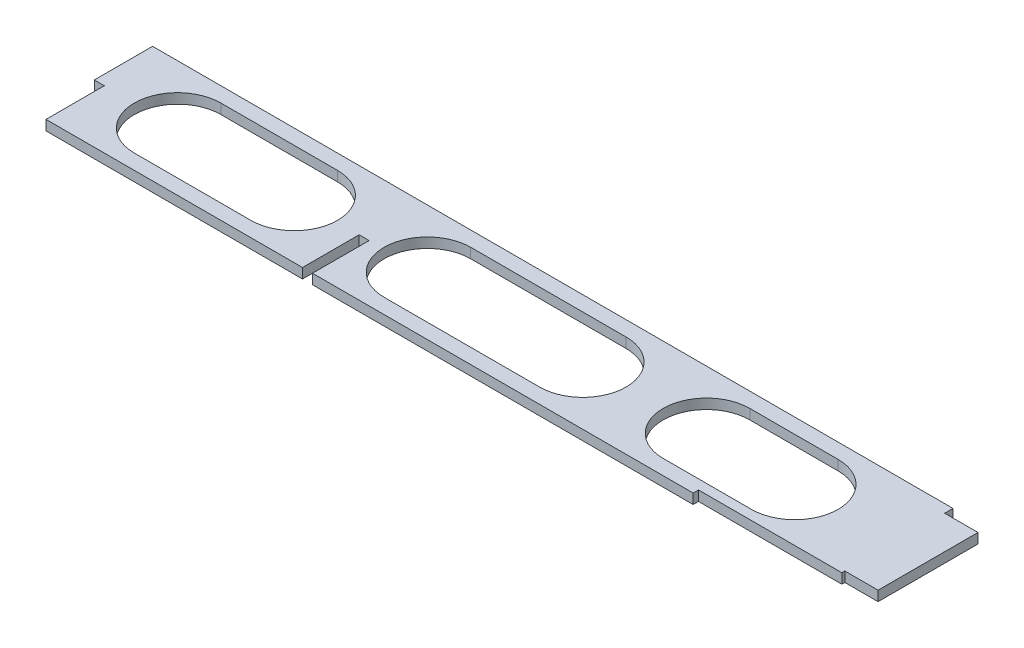
ISO-10303-21;
HEADER;
FILE_DESCRIPTION(('STEP AP214'),'2;1');
FILE_NAME('part.step','',(''),(''),'','','');
FILE_SCHEMA(('AUTOMOTIVE_DESIGN { 1 0 10303 214 1 1 1 1 }'));
ENDSEC;
DATA;
#1=APPLICATION_CONTEXT('core data for automotive mechanical design processes');
#2=APPLICATION_PROTOCOL_DEFINITION('international standard','automotive_design',2000,#1);
#3=PRODUCT_CONTEXT('',#1,'mechanical');
#4=PRODUCT('Part','Part','',(#3));
#5=PRODUCT_RELATED_PRODUCT_CATEGORY('part','',(#4));
#6=PRODUCT_DEFINITION_FORMATION('','',#4);
#7=PRODUCT_DEFINITION_CONTEXT('part definition',#1,'design');
#8=PRODUCT_DEFINITION('design','',#6,#7);
#9=PRODUCT_DEFINITION_SHAPE('','',#8);
#10=(LENGTH_UNIT() NAMED_UNIT(*) SI_UNIT(.MILLI.,.METRE.));
#11=(NAMED_UNIT(*) PLANE_ANGLE_UNIT() SI_UNIT($,.RADIAN.));
#12=(NAMED_UNIT(*) SI_UNIT($,.STERADIAN.) SOLID_ANGLE_UNIT());
#13=UNCERTAINTY_MEASURE_WITH_UNIT(LENGTH_MEASURE(1.E-05),#10,'distance_accuracy_value','');
#14=(GEOMETRIC_REPRESENTATION_CONTEXT(3) GLOBAL_UNCERTAINTY_ASSIGNED_CONTEXT((#13)) GLOBAL_UNIT_ASSIGNED_CONTEXT((#10,
#11,#12)) REPRESENTATION_CONTEXT('',''));
#15=CARTESIAN_POINT('',(0.,0.,0.));
#16=DIRECTION('',(0.,0.,1.));
#17=DIRECTION('',(1.,0.,0.));
#18=AXIS2_PLACEMENT_3D('',#15,#16,#17);
#19=CARTESIAN_POINT('',(0.,3.,17.5));
#20=DIRECTION('',(0.,0.,-1.));
#21=DIRECTION('',(-1.,0.,0.));
#22=AXIS2_PLACEMENT_3D('',#19,#20,#21);
#23=PLANE('',#22);
#24=DIRECTION('',(1.,0.,0.));
#25=VECTOR('',#24,1.);
#26=CARTESIAN_POINT('',(0.,3.,17.5));
#27=LINE('',#26,#25);
#28=CARTESIAN_POINT('',(3.,3.,17.5));
#29=VERTEX_POINT('',#28);
#30=CARTESIAN_POINT('',(80.,3.,17.5));
#31=VERTEX_POINT('',#30);
#32=EDGE_CURVE('E385',#29,#31,#27,.T.);
#33=ORIENTED_EDGE('',*,*,#32,.F.);
#34=DIRECTION('',(0.,1.,0.));
#35=VECTOR('',#34,1.);
#36=CARTESIAN_POINT('',(3.,-7.,17.5));
#37=LINE('',#36,#35);
#38=CARTESIAN_POINT('',(3.,0.,17.5));
#39=VERTEX_POINT('',#38);
#40=EDGE_CURVE('E410',#39,#29,#37,.T.);
#41=ORIENTED_EDGE('',*,*,#40,.F.);
#42=DIRECTION('',(1.,0.,0.));
#43=VECTOR('',#42,1.);
#44=CARTESIAN_POINT('',(0.,0.,17.5));
#45=LINE('',#44,#43);
#46=CARTESIAN_POINT('',(80.,0.,17.5));
#47=VERTEX_POINT('',#46);
#48=EDGE_CURVE('E396',#39,#47,#45,.T.);
#49=ORIENTED_EDGE('',*,*,#48,.T.);
#50=DIRECTION('',(0.,1.,0.));
#51=VECTOR('',#50,1.);
#52=CARTESIAN_POINT('',(80.,0.,17.5));
#53=LINE('',#52,#51);
#54=EDGE_CURVE('E363',#47,#31,#53,.T.);
#55=ORIENTED_EDGE('',*,*,#54,.T.);
#56=EDGE_LOOP('',(#33,#41,#49,#55));
#57=FACE_BOUND('',#56,.T.);
#58=ADVANCED_FACE('F36',(#57),#23,.F.);
#59=CARTESIAN_POINT('',(0.,3.,-17.5));
#60=DIRECTION('',(1.,0.,0.));
#61=DIRECTION('',(0.,0.,-1.));
#62=AXIS2_PLACEMENT_3D('',#59,#60,#61);
#63=PLANE('',#62);
#64=DIRECTION('',(0.,0.,1.));
#65=VECTOR('',#64,1.);
#66=CARTESIAN_POINT('',(0.,0.,-17.5));
#67=LINE('',#66,#65);
#68=CARTESIAN_POINT('',(0.,0.,-17.5));
#69=VERTEX_POINT('',#68);
#70=CARTESIAN_POINT('',(0.,0.,0.));
#71=VERTEX_POINT('',#70);
#72=EDGE_CURVE('E373',#69,#71,#67,.T.);
#73=ORIENTED_EDGE('',*,*,#72,.T.);
#74=DIRECTION('',(0.,1.,0.));
#75=VECTOR('',#74,1.);
#76=CARTESIAN_POINT('',(0.,-7.,0.));
#77=LINE('',#76,#75);
#78=CARTESIAN_POINT('',(0.,3.,0.));
#79=VERTEX_POINT('',#78);
#80=EDGE_CURVE('E417',#71,#79,#77,.T.);
#81=ORIENTED_EDGE('',*,*,#80,.T.);
#82=DIRECTION('',(0.,0.,1.));
#83=VECTOR('',#82,1.);
#84=CARTESIAN_POINT('',(0.,3.,-17.5));
#85=LINE('',#84,#83);
#86=CARTESIAN_POINT('',(0.,3.,-17.5));
#87=VERTEX_POINT('',#86);
#88=EDGE_CURVE('E380',#87,#79,#85,.T.);
#89=ORIENTED_EDGE('',*,*,#88,.F.);
#90=DIRECTION('',(0.,-1.,0.));
#91=VECTOR('',#90,1.);
#92=CARTESIAN_POINT('',(0.,3.,-17.5));
#93=LINE('',#92,#91);
#94=EDGE_CURVE('E392',#87,#69,#93,.T.);
#95=ORIENTED_EDGE('',*,*,#94,.T.);
#96=EDGE_LOOP('',(#73,#81,#89,#95));
#97=FACE_BOUND('',#96,.T.);
#98=ADVANCED_FACE('F38',(#97),#63,.F.);
#99=CARTESIAN_POINT('',(83.,0.,17.5));
#100=VERTEX_POINT('',#99);
#101=CARTESIAN_POINT('',(197.28,0.,17.5));
#102=VERTEX_POINT('',#101);
#103=EDGE_CURVE('E395',#100,#102,#45,.T.);
#104=ORIENTED_EDGE('',*,*,#103,.T.);
#105=DIRECTION('',(0.,-1.,0.));
#106=VECTOR('',#105,1.);
#107=CARTESIAN_POINT('',(197.28,2.99999999999999,17.5));
#108=LINE('',#107,#106);
#109=CARTESIAN_POINT('',(197.28,2.99999999999999,17.5));
#110=VERTEX_POINT('',#109);
#111=EDGE_CURVE('E228',#110,#102,#108,.T.);
#112=ORIENTED_EDGE('',*,*,#111,.F.);
#113=CARTESIAN_POINT('',(83.,3.,17.5));
#114=VERTEX_POINT('',#113);
#115=EDGE_CURVE('E383',#114,#110,#27,.T.);
#116=ORIENTED_EDGE('',*,*,#115,.F.);
#117=DIRECTION('',(0.,1.,0.));
#118=VECTOR('',#117,1.);
#119=CARTESIAN_POINT('',(83.,0.,17.5));
#120=LINE('',#119,#118);
#121=EDGE_CURVE('E376',#100,#114,#120,.T.);
#122=ORIENTED_EDGE('',*,*,#121,.F.);
#123=EDGE_LOOP('',(#104,#112,#116,#122));
#124=FACE_BOUND('',#123,.T.);
#125=ADVANCED_FACE('F476',(#124),#23,.F.);
#126=CARTESIAN_POINT('',(250.28,3.,-17.5));
#127=DIRECTION('',(-1.,0.,0.));
#128=DIRECTION('',(0.,0.,1.));
#129=AXIS2_PLACEMENT_3D('',#126,#127,#128);
#130=PLANE('',#129);
#131=DIRECTION('',(0.,0.,-1.));
#132=VECTOR('',#131,1.);
#133=CARTESIAN_POINT('',(250.28,0.,-17.5));
#134=LINE('',#133,#132);
#135=CARTESIAN_POINT('',(250.28,0.,15.));
#136=VERTEX_POINT('',#135);
#137=CARTESIAN_POINT('',(250.28,0.,-15.));
#138=VERTEX_POINT('',#137);
#139=EDGE_CURVE('E398',#136,#138,#134,.T.);
#140=ORIENTED_EDGE('',*,*,#139,.T.);
#141=DIRECTION('',(0.,1.,0.));
#142=VECTOR('',#141,1.);
#143=CARTESIAN_POINT('',(250.28,-10.3077640640442,-15.));
#144=LINE('',#143,#142);
#145=CARTESIAN_POINT('',(250.28,3.,-15.));
#146=VERTEX_POINT('',#145);
#147=EDGE_CURVE('E426',#138,#146,#144,.T.);
#148=ORIENTED_EDGE('',*,*,#147,.T.);
#149=DIRECTION('',(0.,0.,-1.));
#150=VECTOR('',#149,1.);
#151=CARTESIAN_POINT('',(250.28,3.,-17.5));
#152=LINE('',#151,#150);
#153=CARTESIAN_POINT('',(250.28,3.,15.));
#154=VERTEX_POINT('',#153);
#155=EDGE_CURVE('E387',#154,#146,#152,.T.);
#156=ORIENTED_EDGE('',*,*,#155,.F.);
#157=DIRECTION('',(0.,1.,0.));
#158=VECTOR('',#157,1.);
#159=CARTESIAN_POINT('',(250.28,-10.3077640640442,15.));
#160=LINE('',#159,#158);
#161=EDGE_CURVE('E245',#136,#154,#160,.T.);
#162=ORIENTED_EDGE('',*,*,#161,.F.);
#163=EDGE_LOOP('',(#140,#148,#156,#162));
#164=FACE_BOUND('',#163,.T.);
#165=ADVANCED_FACE('F460',(#164),#130,.F.);
#166=CARTESIAN_POINT('',(0.,3.,-17.5));
#167=DIRECTION('',(0.,0.,1.));
#168=DIRECTION('',(1.,0.,0.));
#169=AXIS2_PLACEMENT_3D('',#166,#167,#168);
#170=PLANE('',#169);
#171=DIRECTION('',(-1.,0.,0.));
#172=VECTOR('',#171,1.);
#173=CARTESIAN_POINT('',(0.,3.,-17.5));
#174=LINE('',#173,#172);
#175=CARTESIAN_POINT('',(240.28,3.,-17.5));
#176=VERTEX_POINT('',#175);
#177=EDGE_CURVE('E390',#176,#87,#174,.T.);
#178=ORIENTED_EDGE('',*,*,#177,.F.);
#179=DIRECTION('',(0.,1.,0.));
#180=VECTOR('',#179,1.);
#181=CARTESIAN_POINT('',(240.28,-10.3077640640442,-17.5));
#182=LINE('',#181,#180);
#183=CARTESIAN_POINT('',(240.28,0.,-17.5));
#184=VERTEX_POINT('',#183);
#185=EDGE_CURVE('E431',#184,#176,#182,.T.);
#186=ORIENTED_EDGE('',*,*,#185,.F.);
#187=DIRECTION('',(-1.,0.,0.));
#188=VECTOR('',#187,1.);
#189=CARTESIAN_POINT('',(0.,0.,-17.5));
#190=LINE('',#189,#188);
#191=EDGE_CURVE('E384',#184,#69,#190,.T.);
#192=ORIENTED_EDGE('',*,*,#191,.T.);
#193=ORIENTED_EDGE('',*,*,#94,.F.);
#194=EDGE_LOOP('',(#178,#186,#192,#193));
#195=FACE_BOUND('',#194,.T.);
#196=ADVANCED_FACE('F472',(#195),#170,.F.);
#197=CARTESIAN_POINT('',(0.,3.,0.));
#198=DIRECTION('',(0.,1.,0.));
#199=DIRECTION('',(0.,0.,1.));
#200=AXIS2_PLACEMENT_3D('',#197,#198,#199);
#201=PLANE('',#200);
#202=DIRECTION('',(0.,0.,1.));
#203=VECTOR('',#202,1.);
#204=CARTESIAN_POINT('',(197.28,2.99999999999999,15.9));
#205=LINE('',#204,#203);
#206=CARTESIAN_POINT('',(197.28,2.99999999999999,15.9));
#207=VERTEX_POINT('',#206);
#208=EDGE_CURVE('E237',#207,#110,#205,.T.);
#209=ORIENTED_EDGE('',*,*,#208,.F.);
#210=DIRECTION('',(-1.,0.,0.));
#211=VECTOR('',#210,1.);
#212=CARTESIAN_POINT('',(240.28,3.,15.9));
#213=LINE('',#212,#211);
#214=CARTESIAN_POINT('',(240.28,3.,15.9));
#215=VERTEX_POINT('',#214);
#216=EDGE_CURVE('E223',#215,#207,#213,.T.);
#217=ORIENTED_EDGE('',*,*,#216,.F.);
#218=DIRECTION('',(0.,0.,1.));
#219=VECTOR('',#218,1.);
#220=CARTESIAN_POINT('',(240.28,3.,17.5));
#221=LINE('',#220,#219);
#222=CARTESIAN_POINT('',(240.28,3.,15.));
#223=VERTEX_POINT('',#222);
#224=EDGE_CURVE('E235',#223,#215,#221,.T.);
#225=ORIENTED_EDGE('',*,*,#224,.F.);
#226=DIRECTION('',(-1.,0.,0.));
#227=VECTOR('',#226,1.);
#228=CARTESIAN_POINT('',(250.28,3.,15.));
#229=LINE('',#228,#227);
#230=EDGE_CURVE('E244',#154,#223,#229,.T.);
#231=ORIENTED_EDGE('',*,*,#230,.F.);
#232=ORIENTED_EDGE('',*,*,#155,.T.);
#233=DIRECTION('',(1.,0.,0.));
#234=VECTOR('',#233,1.);
#235=CARTESIAN_POINT('',(240.28,3.,-15.));
#236=LINE('',#235,#234);
#237=CARTESIAN_POINT('',(240.28,3.,-15.));
#238=VERTEX_POINT('',#237);
#239=EDGE_CURVE('E429',#238,#146,#236,.T.);
#240=ORIENTED_EDGE('',*,*,#239,.F.);
#241=DIRECTION('',(0.,0.,1.));
#242=VECTOR('',#241,1.);
#243=CARTESIAN_POINT('',(240.28,3.,-17.5));
#244=LINE('',#243,#242);
#245=EDGE_CURVE('E247',#176,#238,#244,.T.);
#246=ORIENTED_EDGE('',*,*,#245,.F.);
#247=ORIENTED_EDGE('',*,*,#177,.T.);
#248=ORIENTED_EDGE('',*,*,#88,.T.);
#249=DIRECTION('',(-1.,0.,0.));
#250=VECTOR('',#249,1.);
#251=CARTESIAN_POINT('',(0.,3.,0.));
#252=LINE('',#251,#250);
#253=CARTESIAN_POINT('',(3.,3.,0.));
#254=VERTEX_POINT('',#253);
#255=EDGE_CURVE('E415',#254,#79,#252,.T.);
#256=ORIENTED_EDGE('',*,*,#255,.F.);
#257=DIRECTION('',(0.,0.,-1.));
#258=VECTOR('',#257,1.);
#259=CARTESIAN_POINT('',(3.,3.,0.));
#260=LINE('',#259,#258);
#261=EDGE_CURVE('E419',#29,#254,#260,.T.);
#262=ORIENTED_EDGE('',*,*,#261,.F.);
#263=ORIENTED_EDGE('',*,*,#32,.T.);
#264=DIRECTION('',(0.,0.,1.));
#265=VECTOR('',#264,1.);
#266=CARTESIAN_POINT('',(80.,3.,17.5));
#267=LINE('',#266,#265);
#268=CARTESIAN_POINT('',(80.,3.,0.5));
#269=VERTEX_POINT('',#268);
#270=EDGE_CURVE('E346',#269,#31,#267,.T.);
#271=ORIENTED_EDGE('',*,*,#270,.F.);
#272=DIRECTION('',(-1.,0.,0.));
#273=VECTOR('',#272,1.);
#274=CARTESIAN_POINT('',(80.,3.,0.5));
#275=LINE('',#274,#273);
#276=CARTESIAN_POINT('',(83.,3.,0.5));
#277=VERTEX_POINT('',#276);
#278=EDGE_CURVE('E357',#277,#269,#275,.T.);
#279=ORIENTED_EDGE('',*,*,#278,.F.);
#280=DIRECTION('',(0.,0.,-1.));
#281=VECTOR('',#280,1.);
#282=CARTESIAN_POINT('',(83.,3.,17.5));
#283=LINE('',#282,#281);
#284=EDGE_CURVE('E366',#114,#277,#283,.T.);
#285=ORIENTED_EDGE('',*,*,#284,.F.);
#286=ORIENTED_EDGE('',*,*,#115,.T.);
#287=EDGE_LOOP('',(#209,#217,#225,#231,#232,#240,#246,#247,#248,#256,#262,#263,#271,#279,#285,#286));
#288=FACE_BOUND('',#287,.T.);
#289=CARTESIAN_POINT('',(183.762367308974,3.,0.));
#290=DIRECTION('',(0.,1.,0.));
#291=DIRECTION('',(0.,0.,-1.));
#292=AXIS2_PLACEMENT_3D('',#289,#290,#291);
#293=CIRCLE('',#292,13.);
#294=CARTESIAN_POINT('',(183.762367308974,3.,-13.));
#295=VERTEX_POINT('',#294);
#296=CARTESIAN_POINT('',(183.762367308974,3.,13.));
#297=VERTEX_POINT('',#296);
#298=EDGE_CURVE('E265',#295,#297,#293,.T.);
#299=ORIENTED_EDGE('',*,*,#298,.F.);
#300=DIRECTION('',(-1.,0.,0.));
#301=VECTOR('',#300,1.);
#302=CARTESIAN_POINT('',(183.762367308974,3.,-13.));
#303=LINE('',#302,#301);
#304=CARTESIAN_POINT('',(210.28,3.,-13.));
#305=VERTEX_POINT('',#304);
#306=EDGE_CURVE('E300',#305,#295,#303,.T.);
#307=ORIENTED_EDGE('',*,*,#306,.F.);
#308=CARTESIAN_POINT('',(210.28,3.,0.));
#309=DIRECTION('',(0.,1.,0.));
#310=DIRECTION('',(0.,0.,1.));
#311=AXIS2_PLACEMENT_3D('',#308,#309,#310);
#312=CIRCLE('',#311,13.);
#313=CARTESIAN_POINT('',(210.28,3.,13.));
#314=VERTEX_POINT('',#313);
#315=EDGE_CURVE('E303',#314,#305,#312,.T.);
#316=ORIENTED_EDGE('',*,*,#315,.F.);
#317=DIRECTION('',(1.,0.,0.));
#318=VECTOR('',#317,1.);
#319=CARTESIAN_POINT('',(183.762367308974,3.,13.));
#320=LINE('',#319,#318);
#321=EDGE_CURVE('E307',#297,#314,#320,.T.);
#322=ORIENTED_EDGE('',*,*,#321,.F.);
#323=EDGE_LOOP('',(#299,#307,#316,#322));
#324=FACE_BOUND('',#323,.T.);
#325=CARTESIAN_POINT('',(25.,3.,0.));
#326=DIRECTION('',(0.,1.,0.));
#327=DIRECTION('',(0.,0.,1.));
#328=AXIS2_PLACEMENT_3D('',#325,#326,#327);
#329=CIRCLE('',#328,13.);
#330=CARTESIAN_POINT('',(25.,3.,-13.));
#331=VERTEX_POINT('',#330);
#332=CARTESIAN_POINT('',(25.,3.,13.));
#333=VERTEX_POINT('',#332);
#334=EDGE_CURVE('E276',#331,#333,#329,.T.);
#335=ORIENTED_EDGE('',*,*,#334,.F.);
#336=DIRECTION('',(-1.,0.,0.));
#337=VECTOR('',#336,1.);
#338=CARTESIAN_POINT('',(25.,3.,-13.));
#339=LINE('',#338,#337);
#340=CARTESIAN_POINT('',(60.,3.,-13.));
#341=VERTEX_POINT('',#340);
#342=EDGE_CURVE('E266',#341,#331,#339,.T.);
#343=ORIENTED_EDGE('',*,*,#342,.F.);
#344=CARTESIAN_POINT('',(60.,3.,0.));
#345=DIRECTION('',(0.,1.,0.));
#346=DIRECTION('',(0.,0.,1.));
#347=AXIS2_PLACEMENT_3D('',#344,#345,#346);
#348=CIRCLE('',#347,13.);
#349=CARTESIAN_POINT('',(60.,3.,13.));
#350=VERTEX_POINT('',#349);
#351=EDGE_CURVE('E269',#350,#341,#348,.T.);
#352=ORIENTED_EDGE('',*,*,#351,.F.);
#353=DIRECTION('',(1.,0.,0.));
#354=VECTOR('',#353,1.);
#355=CARTESIAN_POINT('',(25.,3.,13.));
#356=LINE('',#355,#354);
#357=EDGE_CURVE('E273',#333,#350,#356,.T.);
#358=ORIENTED_EDGE('',*,*,#357,.F.);
#359=EDGE_LOOP('',(#335,#343,#352,#358));
#360=FACE_BOUND('',#359,.T.);
#361=CARTESIAN_POINT('',(146.655192756785,3.,0.));
#362=DIRECTION('',(0.,1.,0.));
#363=DIRECTION('',(0.,0.,-1.));
#364=AXIS2_PLACEMENT_3D('',#361,#362,#363);
#365=CIRCLE('',#364,13.);
#366=CARTESIAN_POINT('',(146.655192756785,3.,13.));
#367=VERTEX_POINT('',#366);
#368=CARTESIAN_POINT('',(146.655192756785,3.,-13.));
#369=VERTEX_POINT('',#368);
#370=EDGE_CURVE('E278',#367,#369,#365,.T.);
#371=ORIENTED_EDGE('',*,*,#370,.F.);
#372=DIRECTION('',(1.,0.,0.));
#373=VECTOR('',#372,1.);
#374=CARTESIAN_POINT('',(100.,3.,13.));
#375=LINE('',#374,#373);
#376=CARTESIAN_POINT('',(100.,3.,13.));
#377=VERTEX_POINT('',#376);
#378=EDGE_CURVE('E325',#377,#367,#375,.T.);
#379=ORIENTED_EDGE('',*,*,#378,.F.);
#380=CARTESIAN_POINT('',(100.,3.,0.));
#381=DIRECTION('',(0.,1.,0.));
#382=DIRECTION('',(0.,0.,1.));
#383=AXIS2_PLACEMENT_3D('',#380,#381,#382);
#384=CIRCLE('',#383,13.);
#385=CARTESIAN_POINT('',(100.,3.,-13.));
#386=VERTEX_POINT('',#385);
#387=EDGE_CURVE('E339',#386,#377,#384,.T.);
#388=ORIENTED_EDGE('',*,*,#387,.F.);
#389=DIRECTION('',(-1.,0.,0.));
#390=VECTOR('',#389,1.);
#391=CARTESIAN_POINT('',(100.,3.,-13.));
#392=LINE('',#391,#390);
#393=EDGE_CURVE('E336',#369,#386,#392,.T.);
#394=ORIENTED_EDGE('',*,*,#393,.F.);
#395=EDGE_LOOP('',(#371,#379,#388,#394));
#396=FACE_BOUND('',#395,.T.);
#397=ADVANCED_FACE('F232',(#288,#324,#360,#396),#201,.T.);
#398=CARTESIAN_POINT('',(0.,0.,0.));
#399=DIRECTION('',(0.,1.,0.));
#400=DIRECTION('',(0.,0.,1.));
#401=AXIS2_PLACEMENT_3D('',#398,#399,#400);
#402=PLANE('',#401);
#403=DIRECTION('',(-1.,0.,0.));
#404=VECTOR('',#403,1.);
#405=CARTESIAN_POINT('',(183.762367308974,0.,-13.));
#406=LINE('',#405,#404);
#407=CARTESIAN_POINT('',(210.28,0.,-13.));
#408=VERTEX_POINT('',#407);
#409=CARTESIAN_POINT('',(183.762367308974,0.,-13.));
#410=VERTEX_POINT('',#409);
#411=EDGE_CURVE('E292',#408,#410,#406,.T.);
#412=ORIENTED_EDGE('',*,*,#411,.T.);
#413=CARTESIAN_POINT('',(183.762367308974,0.,0.));
#414=DIRECTION('',(0.,1.,0.));
#415=DIRECTION('',(0.,0.,-1.));
#416=AXIS2_PLACEMENT_3D('',#413,#414,#415);
#417=CIRCLE('',#416,13.);
#418=CARTESIAN_POINT('',(183.762367308974,0.,13.));
#419=VERTEX_POINT('',#418);
#420=EDGE_CURVE('E304',#410,#419,#417,.T.);
#421=ORIENTED_EDGE('',*,*,#420,.T.);
#422=DIRECTION('',(1.,0.,0.));
#423=VECTOR('',#422,1.);
#424=CARTESIAN_POINT('',(183.762367308974,0.,13.));
#425=LINE('',#424,#423);
#426=CARTESIAN_POINT('',(210.28,0.,13.));
#427=VERTEX_POINT('',#426);
#428=EDGE_CURVE('E316',#419,#427,#425,.T.);
#429=ORIENTED_EDGE('',*,*,#428,.T.);
#430=CARTESIAN_POINT('',(210.28,0.,0.));
#431=DIRECTION('',(0.,1.,0.));
#432=DIRECTION('',(0.,0.,1.));
#433=AXIS2_PLACEMENT_3D('',#430,#431,#432);
#434=CIRCLE('',#433,13.);
#435=EDGE_CURVE('E313',#427,#408,#434,.T.);
#436=ORIENTED_EDGE('',*,*,#435,.T.);
#437=EDGE_LOOP('',(#412,#421,#429,#436));
#438=FACE_BOUND('',#437,.T.);
#439=DIRECTION('',(-1.,0.,0.));
#440=VECTOR('',#439,1.);
#441=CARTESIAN_POINT('',(25.,0.,-13.));
#442=LINE('',#441,#440);
#443=CARTESIAN_POINT('',(60.,0.,-13.));
#444=VERTEX_POINT('',#443);
#445=CARTESIAN_POINT('',(25.,0.,-13.));
#446=VERTEX_POINT('',#445);
#447=EDGE_CURVE('E258',#444,#446,#442,.T.);
#448=ORIENTED_EDGE('',*,*,#447,.T.);
#449=CARTESIAN_POINT('',(25.,0.,0.));
#450=DIRECTION('',(0.,1.,0.));
#451=DIRECTION('',(0.,0.,1.));
#452=AXIS2_PLACEMENT_3D('',#449,#450,#451);
#453=CIRCLE('',#452,13.);
#454=CARTESIAN_POINT('',(25.,0.,13.));
#455=VERTEX_POINT('',#454);
#456=EDGE_CURVE('E270',#446,#455,#453,.T.);
#457=ORIENTED_EDGE('',*,*,#456,.T.);
#458=DIRECTION('',(1.,0.,0.));
#459=VECTOR('',#458,1.);
#460=CARTESIAN_POINT('',(25.,0.,13.));
#461=LINE('',#460,#459);
#462=CARTESIAN_POINT('',(60.,0.,13.));
#463=VERTEX_POINT('',#462);
#464=EDGE_CURVE('E284',#455,#463,#461,.T.);
#465=ORIENTED_EDGE('',*,*,#464,.T.);
#466=CARTESIAN_POINT('',(60.,0.,0.));
#467=DIRECTION('',(0.,1.,0.));
#468=DIRECTION('',(0.,0.,1.));
#469=AXIS2_PLACEMENT_3D('',#466,#467,#468);
#470=CIRCLE('',#469,13.);
#471=EDGE_CURVE('E281',#463,#444,#470,.T.);
#472=ORIENTED_EDGE('',*,*,#471,.T.);
#473=EDGE_LOOP('',(#448,#457,#465,#472));
#474=FACE_BOUND('',#473,.T.);
#475=DIRECTION('',(1.,0.,0.));
#476=VECTOR('',#475,1.);
#477=CARTESIAN_POINT('',(100.,0.,13.));
#478=LINE('',#477,#476);
#479=CARTESIAN_POINT('',(100.,0.,13.));
#480=VERTEX_POINT('',#479);
#481=CARTESIAN_POINT('',(146.655192756785,0.,13.));
#482=VERTEX_POINT('',#481);
#483=EDGE_CURVE('E331',#480,#482,#478,.T.);
#484=ORIENTED_EDGE('',*,*,#483,.T.);
#485=CARTESIAN_POINT('',(146.655192756785,0.,0.));
#486=DIRECTION('',(0.,1.,0.));
#487=DIRECTION('',(0.,0.,-1.));
#488=AXIS2_PLACEMENT_3D('',#485,#486,#487);
#489=CIRCLE('',#488,13.);
#490=CARTESIAN_POINT('',(146.655192756785,0.,-13.));
#491=VERTEX_POINT('',#490);
#492=EDGE_CURVE('E321',#482,#491,#489,.T.);
#493=ORIENTED_EDGE('',*,*,#492,.T.);
#494=DIRECTION('',(-1.,0.,0.));
#495=VECTOR('',#494,1.);
#496=CARTESIAN_POINT('',(100.,0.,-13.));
#497=LINE('',#496,#495);
#498=CARTESIAN_POINT('',(100.,0.,-13.));
#499=VERTEX_POINT('',#498);
#500=EDGE_CURVE('E324',#491,#499,#497,.T.);
#501=ORIENTED_EDGE('',*,*,#500,.T.);
#502=CARTESIAN_POINT('',(100.,0.,0.));
#503=DIRECTION('',(0.,1.,0.));
#504=DIRECTION('',(0.,0.,1.));
#505=AXIS2_PLACEMENT_3D('',#502,#503,#504);
#506=CIRCLE('',#505,13.);
#507=EDGE_CURVE('E328',#499,#480,#506,.T.);
#508=ORIENTED_EDGE('',*,*,#507,.T.);
#509=EDGE_LOOP('',(#484,#493,#501,#508));
#510=FACE_BOUND('',#509,.T.);
#511=DIRECTION('',(1.,0.,0.));
#512=VECTOR('',#511,1.);
#513=CARTESIAN_POINT('',(240.28,0.,15.9));
#514=LINE('',#513,#512);
#515=CARTESIAN_POINT('',(197.28,0.,15.9));
#516=VERTEX_POINT('',#515);
#517=CARTESIAN_POINT('',(240.28,0.,15.9));
#518=VERTEX_POINT('',#517);
#519=EDGE_CURVE('E51',#516,#518,#514,.T.);
#520=ORIENTED_EDGE('',*,*,#519,.F.);
#521=DIRECTION('',(0.,0.,1.));
#522=VECTOR('',#521,1.);
#523=CARTESIAN_POINT('',(197.28,0.,15.9));
#524=LINE('',#523,#522);
#525=EDGE_CURVE('E446',#516,#102,#524,.T.);
#526=ORIENTED_EDGE('',*,*,#525,.T.);
#527=ORIENTED_EDGE('',*,*,#103,.F.);
#528=DIRECTION('',(0.,0.,-1.));
#529=VECTOR('',#528,1.);
#530=CARTESIAN_POINT('',(83.,0.,17.5));
#531=LINE('',#530,#529);
#532=CARTESIAN_POINT('',(83.,0.,0.5));
#533=VERTEX_POINT('',#532);
#534=EDGE_CURVE('E356',#100,#533,#531,.T.);
#535=ORIENTED_EDGE('',*,*,#534,.T.);
#536=DIRECTION('',(-1.,0.,0.));
#537=VECTOR('',#536,1.);
#538=CARTESIAN_POINT('',(80.,0.,0.5));
#539=LINE('',#538,#537);
#540=CARTESIAN_POINT('',(80.,0.,0.5));
#541=VERTEX_POINT('',#540);
#542=EDGE_CURVE('E360',#533,#541,#539,.T.);
#543=ORIENTED_EDGE('',*,*,#542,.T.);
#544=DIRECTION('',(0.,0.,1.));
#545=VECTOR('',#544,1.);
#546=CARTESIAN_POINT('',(80.,0.,17.5));
#547=LINE('',#546,#545);
#548=EDGE_CURVE('E353',#541,#47,#547,.T.);
#549=ORIENTED_EDGE('',*,*,#548,.T.);
#550=ORIENTED_EDGE('',*,*,#48,.F.);
#551=DIRECTION('',(0.,0.,-1.));
#552=VECTOR('',#551,1.);
#553=CARTESIAN_POINT('',(3.,0.,0.));
#554=LINE('',#553,#552);
#555=CARTESIAN_POINT('',(3.,0.,0.));
#556=VERTEX_POINT('',#555);
#557=EDGE_CURVE('E44',#39,#556,#554,.T.);
#558=ORIENTED_EDGE('',*,*,#557,.T.);
#559=DIRECTION('',(-1.,0.,0.));
#560=VECTOR('',#559,1.);
#561=CARTESIAN_POINT('',(0.,0.,0.));
#562=LINE('',#561,#560);
#563=EDGE_CURVE('E11',#556,#71,#562,.T.);
#564=ORIENTED_EDGE('',*,*,#563,.T.);
#565=ORIENTED_EDGE('',*,*,#72,.F.);
#566=ORIENTED_EDGE('',*,*,#191,.F.);
#567=DIRECTION('',(0.,0.,-1.));
#568=VECTOR('',#567,1.);
#569=CARTESIAN_POINT('',(240.28,0.,-17.5));
#570=LINE('',#569,#568);
#571=CARTESIAN_POINT('',(240.28,0.,-15.));
#572=VERTEX_POINT('',#571);
#573=EDGE_CURVE('E299',#572,#184,#570,.T.);
#574=ORIENTED_EDGE('',*,*,#573,.F.);
#575=DIRECTION('',(-1.,0.,0.));
#576=VECTOR('',#575,1.);
#577=CARTESIAN_POINT('',(240.28,0.,-15.));
#578=LINE('',#577,#576);
#579=EDGE_CURVE('E423',#138,#572,#578,.T.);
#580=ORIENTED_EDGE('',*,*,#579,.F.);
#581=ORIENTED_EDGE('',*,*,#139,.F.);
#582=DIRECTION('',(1.,0.,0.));
#583=VECTOR('',#582,1.);
#584=CARTESIAN_POINT('',(250.28,0.,15.));
#585=LINE('',#584,#583);
#586=CARTESIAN_POINT('',(240.28,0.,15.));
#587=VERTEX_POINT('',#586);
#588=EDGE_CURVE('E254',#587,#136,#585,.T.);
#589=ORIENTED_EDGE('',*,*,#588,.F.);
#590=DIRECTION('',(0.,0.,-1.));
#591=VECTOR('',#590,1.);
#592=CARTESIAN_POINT('',(240.28,0.,17.5));
#593=LINE('',#592,#591);
#594=EDGE_CURVE('E252',#518,#587,#593,.T.);
#595=ORIENTED_EDGE('',*,*,#594,.F.);
#596=EDGE_LOOP('',(#520,#526,#527,#535,#543,#549,#550,#558,#564,#565,#566,#574,#580,#581,#589,#595));
#597=FACE_BOUND('',#596,.T.);
#598=ADVANCED_FACE('F406',(#438,#474,#510,#597),#402,.F.);
#599=CARTESIAN_POINT('',(80.,0.,17.5));
#600=DIRECTION('',(-1.,0.,0.));
#601=DIRECTION('',(0.,0.,1.));
#602=AXIS2_PLACEMENT_3D('',#599,#600,#601);
#603=PLANE('',#602);
#604=ORIENTED_EDGE('',*,*,#270,.T.);
#605=ORIENTED_EDGE('',*,*,#54,.F.);
#606=ORIENTED_EDGE('',*,*,#548,.F.);
#607=DIRECTION('',(0.,1.,0.));
#608=VECTOR('',#607,1.);
#609=CARTESIAN_POINT('',(80.,0.,0.5));
#610=LINE('',#609,#608);
#611=EDGE_CURVE('E371',#541,#269,#610,.T.);
#612=ORIENTED_EDGE('',*,*,#611,.T.);
#613=EDGE_LOOP('',(#604,#605,#606,#612));
#614=FACE_BOUND('',#613,.T.);
#615=ADVANCED_FACE('F491',(#614),#603,.F.);
#616=CARTESIAN_POINT('',(80.,0.,0.5));
#617=DIRECTION('',(0.,0.,-1.));
#618=DIRECTION('',(-1.,0.,0.));
#619=AXIS2_PLACEMENT_3D('',#616,#617,#618);
#620=PLANE('',#619);
#621=ORIENTED_EDGE('',*,*,#278,.T.);
#622=ORIENTED_EDGE('',*,*,#611,.F.);
#623=ORIENTED_EDGE('',*,*,#542,.F.);
#624=DIRECTION('',(0.,1.,0.));
#625=VECTOR('',#624,1.);
#626=CARTESIAN_POINT('',(83.,0.,0.5));
#627=LINE('',#626,#625);
#628=EDGE_CURVE('E374',#533,#277,#627,.T.);
#629=ORIENTED_EDGE('',*,*,#628,.T.);
#630=EDGE_LOOP('',(#621,#622,#623,#629));
#631=FACE_BOUND('',#630,.T.);
#632=ADVANCED_FACE('F497',(#631),#620,.F.);
#633=CARTESIAN_POINT('',(83.,0.,17.5));
#634=DIRECTION('',(1.,0.,0.));
#635=DIRECTION('',(0.,0.,-1.));
#636=AXIS2_PLACEMENT_3D('',#633,#634,#635);
#637=PLANE('',#636);
#638=ORIENTED_EDGE('',*,*,#284,.T.);
#639=ORIENTED_EDGE('',*,*,#628,.F.);
#640=ORIENTED_EDGE('',*,*,#534,.F.);
#641=ORIENTED_EDGE('',*,*,#121,.T.);
#642=EDGE_LOOP('',(#638,#639,#640,#641));
#643=FACE_BOUND('',#642,.T.);
#644=ADVANCED_FACE('F499',(#643),#637,.F.);
#645=CARTESIAN_POINT('',(146.655192756785,0.,0.));
#646=DIRECTION('',(0.,1.,0.));
#647=DIRECTION('',(0.,0.,1.));
#648=AXIS2_PLACEMENT_3D('',#645,#646,#647);
#649=CYLINDRICAL_SURFACE('',#648,13.);
#650=ORIENTED_EDGE('',*,*,#370,.T.);
#651=DIRECTION('',(0.,1.,0.));
#652=VECTOR('',#651,1.);
#653=CARTESIAN_POINT('',(146.655192756785,0.,-13.));
#654=LINE('',#653,#652);
#655=EDGE_CURVE('E334',#491,#369,#654,.T.);
#656=ORIENTED_EDGE('',*,*,#655,.F.);
#657=ORIENTED_EDGE('',*,*,#492,.F.);
#658=DIRECTION('',(0.,1.,0.));
#659=VECTOR('',#658,1.);
#660=CARTESIAN_POINT('',(146.655192756785,0.,13.));
#661=LINE('',#660,#659);
#662=EDGE_CURVE('E344',#482,#367,#661,.T.);
#663=ORIENTED_EDGE('',*,*,#662,.T.);
#664=EDGE_LOOP('',(#650,#656,#657,#663));
#665=FACE_BOUND('',#664,.T.);
#666=ADVANCED_FACE('F502',(#665),#649,.F.);
#667=CARTESIAN_POINT('',(100.,0.,13.));
#668=DIRECTION('',(0.,0.,1.));
#669=DIRECTION('',(1.,0.,0.));
#670=AXIS2_PLACEMENT_3D('',#667,#668,#669);
#671=PLANE('',#670);
#672=ORIENTED_EDGE('',*,*,#378,.T.);
#673=ORIENTED_EDGE('',*,*,#662,.F.);
#674=ORIENTED_EDGE('',*,*,#483,.F.);
#675=DIRECTION('',(0.,1.,0.));
#676=VECTOR('',#675,1.);
#677=CARTESIAN_POINT('',(100.,0.,13.));
#678=LINE('',#677,#676);
#679=EDGE_CURVE('E347',#480,#377,#678,.T.);
#680=ORIENTED_EDGE('',*,*,#679,.T.);
#681=EDGE_LOOP('',(#672,#673,#674,#680));
#682=FACE_BOUND('',#681,.T.);
#683=ADVANCED_FACE('F509',(#682),#671,.F.);
#684=CARTESIAN_POINT('',(100.,0.,0.));
#685=DIRECTION('',(0.,1.,0.));
#686=DIRECTION('',(0.,0.,1.));
#687=AXIS2_PLACEMENT_3D('',#684,#685,#686);
#688=CYLINDRICAL_SURFACE('',#687,13.);
#689=ORIENTED_EDGE('',*,*,#387,.T.);
#690=ORIENTED_EDGE('',*,*,#679,.F.);
#691=ORIENTED_EDGE('',*,*,#507,.F.);
#692=DIRECTION('',(0.,1.,0.));
#693=VECTOR('',#692,1.);
#694=CARTESIAN_POINT('',(100.,0.,-13.));
#695=LINE('',#694,#693);
#696=EDGE_CURVE('E349',#499,#386,#695,.T.);
#697=ORIENTED_EDGE('',*,*,#696,.T.);
#698=EDGE_LOOP('',(#689,#690,#691,#697));
#699=FACE_BOUND('',#698,.T.);
#700=ADVANCED_FACE('F515',(#699),#688,.F.);
#701=CARTESIAN_POINT('',(100.,0.,-13.));
#702=DIRECTION('',(0.,0.,-1.));
#703=DIRECTION('',(-1.,0.,0.));
#704=AXIS2_PLACEMENT_3D('',#701,#702,#703);
#705=PLANE('',#704);
#706=ORIENTED_EDGE('',*,*,#393,.T.);
#707=ORIENTED_EDGE('',*,*,#696,.F.);
#708=ORIENTED_EDGE('',*,*,#500,.F.);
#709=ORIENTED_EDGE('',*,*,#655,.T.);
#710=EDGE_LOOP('',(#706,#707,#708,#709));
#711=FACE_BOUND('',#710,.T.);
#712=ADVANCED_FACE('F511',(#711),#705,.F.);
#713=CARTESIAN_POINT('',(25.,0.,0.));
#714=DIRECTION('',(0.,1.,0.));
#715=DIRECTION('',(0.,0.,1.));
#716=AXIS2_PLACEMENT_3D('',#713,#714,#715);
#717=CYLINDRICAL_SURFACE('',#716,13.);
#718=ORIENTED_EDGE('',*,*,#334,.T.);
#719=DIRECTION('',(0.,1.,0.));
#720=VECTOR('',#719,1.);
#721=CARTESIAN_POINT('',(25.,0.,13.));
#722=LINE('',#721,#720);
#723=EDGE_CURVE('E255',#455,#333,#722,.T.);
#724=ORIENTED_EDGE('',*,*,#723,.F.);
#725=ORIENTED_EDGE('',*,*,#456,.F.);
#726=DIRECTION('',(0.,1.,0.));
#727=VECTOR('',#726,1.);
#728=CARTESIAN_POINT('',(25.,0.,-13.));
#729=LINE('',#728,#727);
#730=EDGE_CURVE('E263',#446,#331,#729,.T.);
#731=ORIENTED_EDGE('',*,*,#730,.T.);
#732=EDGE_LOOP('',(#718,#724,#725,#731));
#733=FACE_BOUND('',#732,.T.);
#734=ADVANCED_FACE('F514',(#733),#717,.F.);
#735=CARTESIAN_POINT('',(25.,0.,-13.));
#736=DIRECTION('',(0.,0.,-1.));
#737=DIRECTION('',(-1.,0.,0.));
#738=AXIS2_PLACEMENT_3D('',#735,#736,#737);
#739=PLANE('',#738);
#740=ORIENTED_EDGE('',*,*,#342,.T.);
#741=ORIENTED_EDGE('',*,*,#730,.F.);
#742=ORIENTED_EDGE('',*,*,#447,.F.);
#743=DIRECTION('',(0.,1.,0.));
#744=VECTOR('',#743,1.);
#745=CARTESIAN_POINT('',(60.,0.,-13.));
#746=LINE('',#745,#744);
#747=EDGE_CURVE('E261',#444,#341,#746,.T.);
#748=ORIENTED_EDGE('',*,*,#747,.T.);
#749=EDGE_LOOP('',(#740,#741,#742,#748));
#750=FACE_BOUND('',#749,.T.);
#751=ADVANCED_FACE('F540',(#750),#739,.F.);
#752=CARTESIAN_POINT('',(60.,0.,0.));
#753=DIRECTION('',(0.,1.,0.));
#754=DIRECTION('',(0.,0.,1.));
#755=AXIS2_PLACEMENT_3D('',#752,#753,#754);
#756=CYLINDRICAL_SURFACE('',#755,13.);
#757=ORIENTED_EDGE('',*,*,#351,.T.);
#758=ORIENTED_EDGE('',*,*,#747,.F.);
#759=ORIENTED_EDGE('',*,*,#471,.F.);
#760=DIRECTION('',(0.,1.,0.));
#761=VECTOR('',#760,1.);
#762=CARTESIAN_POINT('',(60.,0.,13.));
#763=LINE('',#762,#761);
#764=EDGE_CURVE('E259',#463,#350,#763,.T.);
#765=ORIENTED_EDGE('',*,*,#764,.T.);
#766=EDGE_LOOP('',(#757,#758,#759,#765));
#767=FACE_BOUND('',#766,.T.);
#768=ADVANCED_FACE('F543',(#767),#756,.F.);
#769=CARTESIAN_POINT('',(25.,0.,13.));
#770=DIRECTION('',(0.,0.,1.));
#771=DIRECTION('',(1.,0.,0.));
#772=AXIS2_PLACEMENT_3D('',#769,#770,#771);
#773=PLANE('',#772);
#774=ORIENTED_EDGE('',*,*,#357,.T.);
#775=ORIENTED_EDGE('',*,*,#764,.F.);
#776=ORIENTED_EDGE('',*,*,#464,.F.);
#777=ORIENTED_EDGE('',*,*,#723,.T.);
#778=EDGE_LOOP('',(#774,#775,#776,#777));
#779=FACE_BOUND('',#778,.T.);
#780=ADVANCED_FACE('F538',(#779),#773,.F.);
#781=CARTESIAN_POINT('',(183.762367308974,0.,0.));
#782=DIRECTION('',(0.,1.,0.));
#783=DIRECTION('',(0.,0.,1.));
#784=AXIS2_PLACEMENT_3D('',#781,#782,#783);
#785=CYLINDRICAL_SURFACE('',#784,13.);
#786=ORIENTED_EDGE('',*,*,#298,.T.);
#787=DIRECTION('',(0.,1.,0.));
#788=VECTOR('',#787,1.);
#789=CARTESIAN_POINT('',(183.762367308974,0.,13.));
#790=LINE('',#789,#788);
#791=EDGE_CURVE('E289',#419,#297,#790,.T.);
#792=ORIENTED_EDGE('',*,*,#791,.F.);
#793=ORIENTED_EDGE('',*,*,#420,.F.);
#794=DIRECTION('',(0.,1.,0.));
#795=VECTOR('',#794,1.);
#796=CARTESIAN_POINT('',(183.762367308974,0.,-13.));
#797=LINE('',#796,#795);
#798=EDGE_CURVE('E297',#410,#295,#797,.T.);
#799=ORIENTED_EDGE('',*,*,#798,.T.);
#800=EDGE_LOOP('',(#786,#792,#793,#799));
#801=FACE_BOUND('',#800,.T.);
#802=ADVANCED_FACE('F527',(#801),#785,.F.);
#803=CARTESIAN_POINT('',(183.762367308974,0.,-13.));
#804=DIRECTION('',(0.,0.,-1.));
#805=DIRECTION('',(-1.,0.,0.));
#806=AXIS2_PLACEMENT_3D('',#803,#804,#805);
#807=PLANE('',#806);
#808=ORIENTED_EDGE('',*,*,#306,.T.);
#809=ORIENTED_EDGE('',*,*,#798,.F.);
#810=ORIENTED_EDGE('',*,*,#411,.F.);
#811=DIRECTION('',(0.,1.,0.));
#812=VECTOR('',#811,1.);
#813=CARTESIAN_POINT('',(210.28,0.,-13.));
#814=LINE('',#813,#812);
#815=EDGE_CURVE('E295',#408,#305,#814,.T.);
#816=ORIENTED_EDGE('',*,*,#815,.T.);
#817=EDGE_LOOP('',(#808,#809,#810,#816));
#818=FACE_BOUND('',#817,.T.);
#819=ADVANCED_FACE('F523',(#818),#807,.F.);
#820=CARTESIAN_POINT('',(210.28,0.,0.));
#821=DIRECTION('',(0.,1.,0.));
#822=DIRECTION('',(0.,0.,1.));
#823=AXIS2_PLACEMENT_3D('',#820,#821,#822);
#824=CYLINDRICAL_SURFACE('',#823,13.);
#825=ORIENTED_EDGE('',*,*,#315,.T.);
#826=ORIENTED_EDGE('',*,*,#815,.F.);
#827=ORIENTED_EDGE('',*,*,#435,.F.);
#828=DIRECTION('',(0.,1.,0.));
#829=VECTOR('',#828,1.);
#830=CARTESIAN_POINT('',(210.28,0.,13.));
#831=LINE('',#830,#829);
#832=EDGE_CURVE('E293',#427,#314,#831,.T.);
#833=ORIENTED_EDGE('',*,*,#832,.T.);
#834=EDGE_LOOP('',(#825,#826,#827,#833));
#835=FACE_BOUND('',#834,.T.);
#836=ADVANCED_FACE('F526',(#835),#824,.F.);
#837=CARTESIAN_POINT('',(183.762367308974,0.,13.));
#838=DIRECTION('',(0.,0.,1.));
#839=DIRECTION('',(1.,0.,0.));
#840=AXIS2_PLACEMENT_3D('',#837,#838,#839);
#841=PLANE('',#840);
#842=ORIENTED_EDGE('',*,*,#321,.T.);
#843=ORIENTED_EDGE('',*,*,#832,.F.);
#844=ORIENTED_EDGE('',*,*,#428,.F.);
#845=ORIENTED_EDGE('',*,*,#791,.T.);
#846=EDGE_LOOP('',(#842,#843,#844,#845));
#847=FACE_BOUND('',#846,.T.);
#848=ADVANCED_FACE('F531',(#847),#841,.F.);
#849=CARTESIAN_POINT('',(240.28,-10.3077640640442,17.5));
#850=DIRECTION('',(-1.,0.,0.));
#851=DIRECTION('',(0.,0.,1.));
#852=AXIS2_PLACEMENT_3D('',#849,#850,#851);
#853=PLANE('',#852);
#854=ORIENTED_EDGE('',*,*,#224,.T.);
#855=DIRECTION('',(0.,1.,0.));
#856=VECTOR('',#855,1.);
#857=CARTESIAN_POINT('',(240.28,3.,15.9));
#858=LINE('',#857,#856);
#859=EDGE_CURVE('E220',#518,#215,#858,.T.);
#860=ORIENTED_EDGE('',*,*,#859,.F.);
#861=ORIENTED_EDGE('',*,*,#594,.T.);
#862=DIRECTION('',(0.,1.,0.));
#863=VECTOR('',#862,1.);
#864=CARTESIAN_POINT('',(240.28,-10.3077640640442,15.));
#865=LINE('',#864,#863);
#866=EDGE_CURVE('E242',#587,#223,#865,.T.);
#867=ORIENTED_EDGE('',*,*,#866,.T.);
#868=EDGE_LOOP('',(#854,#860,#861,#867));
#869=FACE_BOUND('',#868,.T.);
#870=ADVANCED_FACE('F240',(#869),#853,.F.);
#871=CARTESIAN_POINT('',(250.28,-10.3077640640442,15.));
#872=DIRECTION('',(0.,0.,-1.));
#873=DIRECTION('',(-1.,0.,0.));
#874=AXIS2_PLACEMENT_3D('',#871,#872,#873);
#875=PLANE('',#874);
#876=ORIENTED_EDGE('',*,*,#588,.T.);
#877=ORIENTED_EDGE('',*,*,#161,.T.);
#878=ORIENTED_EDGE('',*,*,#230,.T.);
#879=ORIENTED_EDGE('',*,*,#866,.F.);
#880=EDGE_LOOP('',(#876,#877,#878,#879));
#881=FACE_BOUND('',#880,.T.);
#882=ADVANCED_FACE('F456',(#881),#875,.F.);
#883=CARTESIAN_POINT('',(240.28,-10.3077640640442,-15.));
#884=DIRECTION('',(0.,0.,1.));
#885=DIRECTION('',(1.,0.,0.));
#886=AXIS2_PLACEMENT_3D('',#883,#884,#885);
#887=PLANE('',#886);
#888=ORIENTED_EDGE('',*,*,#579,.T.);
#889=DIRECTION('',(0.,1.,0.));
#890=VECTOR('',#889,1.);
#891=CARTESIAN_POINT('',(240.28,-10.3077640640442,-15.));
#892=LINE('',#891,#890);
#893=EDGE_CURVE('E434',#572,#238,#892,.T.);
#894=ORIENTED_EDGE('',*,*,#893,.T.);
#895=ORIENTED_EDGE('',*,*,#239,.T.);
#896=ORIENTED_EDGE('',*,*,#147,.F.);
#897=EDGE_LOOP('',(#888,#894,#895,#896));
#898=FACE_BOUND('',#897,.T.);
#899=ADVANCED_FACE('F463',(#898),#887,.F.);
#900=CARTESIAN_POINT('',(240.28,-10.3077640640442,-17.5));
#901=DIRECTION('',(-1.,0.,0.));
#902=DIRECTION('',(0.,0.,1.));
#903=AXIS2_PLACEMENT_3D('',#900,#901,#902);
#904=PLANE('',#903);
#905=ORIENTED_EDGE('',*,*,#573,.T.);
#906=ORIENTED_EDGE('',*,*,#185,.T.);
#907=ORIENTED_EDGE('',*,*,#245,.T.);
#908=ORIENTED_EDGE('',*,*,#893,.F.);
#909=EDGE_LOOP('',(#905,#906,#907,#908));
#910=FACE_BOUND('',#909,.T.);
#911=ADVANCED_FACE('F468',(#910),#904,.F.);
#912=CARTESIAN_POINT('',(0.,-7.,0.));
#913=DIRECTION('',(0.,0.,-1.));
#914=DIRECTION('',(-1.,0.,0.));
#915=AXIS2_PLACEMENT_3D('',#912,#913,#914);
#916=PLANE('',#915);
#917=DIRECTION('',(0.,1.,0.));
#918=VECTOR('',#917,1.);
#919=CARTESIAN_POINT('',(3.,-7.,0.));
#920=LINE('',#919,#918);
#921=EDGE_CURVE('E59',#556,#254,#920,.T.);
#922=ORIENTED_EDGE('',*,*,#921,.T.);
#923=ORIENTED_EDGE('',*,*,#255,.T.);
#924=ORIENTED_EDGE('',*,*,#80,.F.);
#925=ORIENTED_EDGE('',*,*,#563,.F.);
#926=EDGE_LOOP('',(#922,#923,#924,#925));
#927=FACE_BOUND('',#926,.T.);
#928=ADVANCED_FACE('F560',(#927),#916,.F.);
#929=CARTESIAN_POINT('',(3.,-7.,0.));
#930=DIRECTION('',(1.,0.,0.));
#931=DIRECTION('',(0.,0.,-1.));
#932=AXIS2_PLACEMENT_3D('',#929,#930,#931);
#933=PLANE('',#932);
#934=ORIENTED_EDGE('',*,*,#40,.T.);
#935=ORIENTED_EDGE('',*,*,#261,.T.);
#936=ORIENTED_EDGE('',*,*,#921,.F.);
#937=ORIENTED_EDGE('',*,*,#557,.F.);
#938=EDGE_LOOP('',(#934,#935,#936,#937));
#939=FACE_BOUND('',#938,.T.);
#940=ADVANCED_FACE('F409',(#939),#933,.F.);
#941=CARTESIAN_POINT('',(197.28,2.99999999999999,15.9));
#942=DIRECTION('',(-1.,0.,0.));
#943=DIRECTION('',(0.,0.,1.));
#944=AXIS2_PLACEMENT_3D('',#941,#942,#943);
#945=PLANE('',#944);
#946=ORIENTED_EDGE('',*,*,#111,.T.);
#947=ORIENTED_EDGE('',*,*,#525,.F.);
#948=DIRECTION('',(0.,-1.,0.));
#949=VECTOR('',#948,1.);
#950=CARTESIAN_POINT('',(197.28,2.99999999999999,15.9));
#951=LINE('',#950,#949);
#952=EDGE_CURVE('E238',#207,#516,#951,.T.);
#953=ORIENTED_EDGE('',*,*,#952,.F.);
#954=ORIENTED_EDGE('',*,*,#208,.T.);
#955=EDGE_LOOP('',(#946,#947,#953,#954));
#956=FACE_BOUND('',#955,.T.);
#957=ADVANCED_FACE('F565',(#956),#945,.F.);
#958=CARTESIAN_POINT('',(0.,0.,15.9));
#959=DIRECTION('',(0.,0.,-1.));
#960=DIRECTION('',(-1.,0.,0.));
#961=AXIS2_PLACEMENT_3D('',#958,#959,#960);
#962=PLANE('',#961);
#963=ORIENTED_EDGE('',*,*,#859,.T.);
#964=ORIENTED_EDGE('',*,*,#216,.T.);
#965=ORIENTED_EDGE('',*,*,#952,.T.);
#966=ORIENTED_EDGE('',*,*,#519,.T.);
#967=EDGE_LOOP('',(#963,#964,#965,#966));
#968=FACE_BOUND('',#967,.T.);
#969=ADVANCED_FACE('F222',(#968),#962,.F.);
#970=CLOSED_SHELL('',(#58,#98,#125,#165,#196,#397,#598,#615,#632,#644,#666,#683,#700,#712,#734,
#751,#768,#780,#802,#819,#836,#848,#870,#882,#899,#911,#928,#940,#957,#969));
#971=MANIFOLD_SOLID_BREP('B2',#970);
#972=ADVANCED_BREP_SHAPE_REPRESENTATION('',(#18,#971),#14);
#973=SHAPE_DEFINITION_REPRESENTATION(#9,#972);
ENDSEC;
END-ISO-10303-21;
